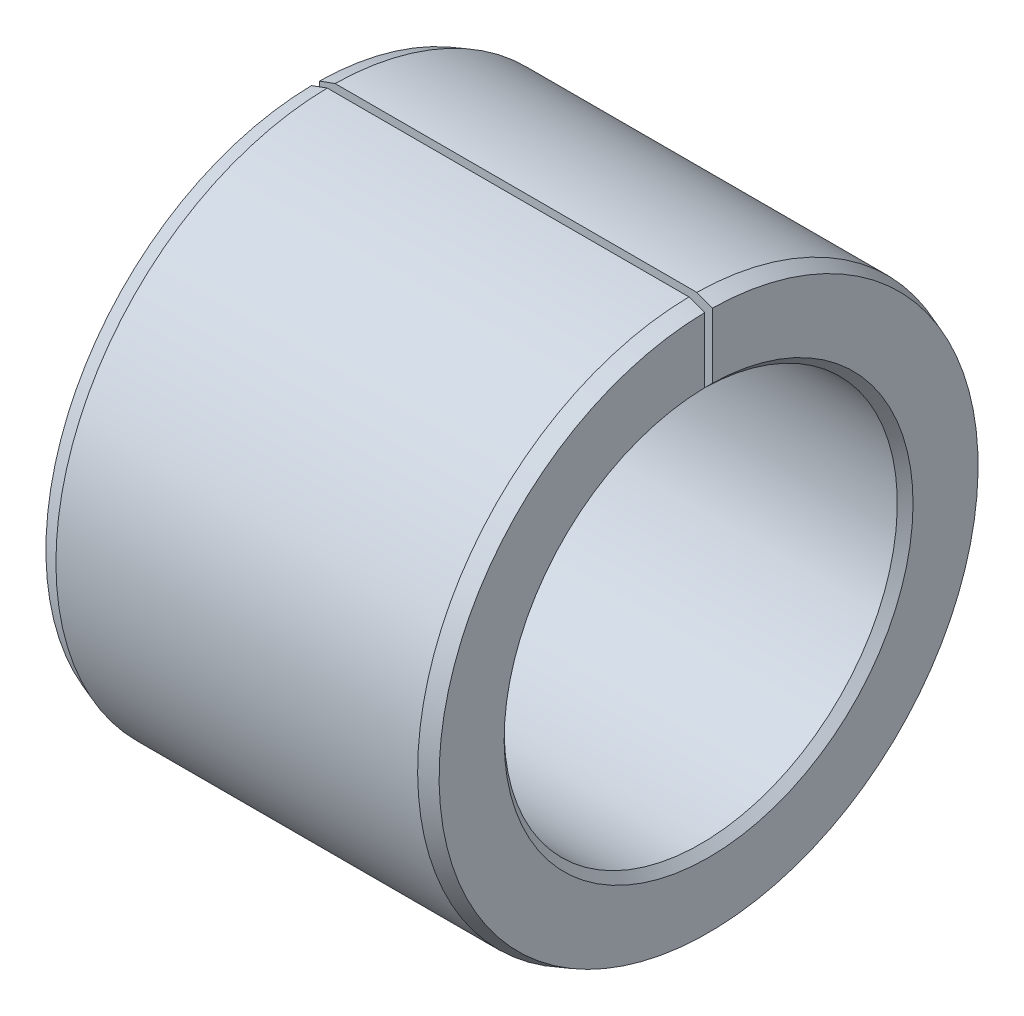
ISO-10303-21;
HEADER;
FILE_DESCRIPTION(('STEP AP214'),'2;1');
FILE_NAME('part.step','',(''),(''),'','','');
FILE_SCHEMA(('AUTOMOTIVE_DESIGN { 1 0 10303 214 1 1 1 1 }'));
ENDSEC;
DATA;
#1=APPLICATION_CONTEXT('core data for automotive mechanical design processes');
#2=APPLICATION_PROTOCOL_DEFINITION('international standard','automotive_design',2000,#1);
#3=PRODUCT_CONTEXT('',#1,'mechanical');
#4=PRODUCT('Part','Part','',(#3));
#5=PRODUCT_RELATED_PRODUCT_CATEGORY('part','',(#4));
#6=PRODUCT_DEFINITION_FORMATION('','',#4);
#7=PRODUCT_DEFINITION_CONTEXT('part definition',#1,'design');
#8=PRODUCT_DEFINITION('design','',#6,#7);
#9=PRODUCT_DEFINITION_SHAPE('','',#8);
#10=(LENGTH_UNIT() NAMED_UNIT(*) SI_UNIT(.MILLI.,.METRE.));
#11=(NAMED_UNIT(*) PLANE_ANGLE_UNIT() SI_UNIT($,.RADIAN.));
#12=(NAMED_UNIT(*) SI_UNIT($,.STERADIAN.) SOLID_ANGLE_UNIT());
#13=UNCERTAINTY_MEASURE_WITH_UNIT(LENGTH_MEASURE(1.E-05),#10,'distance_accuracy_value','');
#14=(GEOMETRIC_REPRESENTATION_CONTEXT(3) GLOBAL_UNCERTAINTY_ASSIGNED_CONTEXT((#13)) GLOBAL_UNIT_ASSIGNED_CONTEXT((#10,
#11,#12)) REPRESENTATION_CONTEXT('',''));
#15=CARTESIAN_POINT('',(0.,0.,0.));
#16=DIRECTION('',(0.,0.,1.));
#17=DIRECTION('',(1.,0.,0.));
#18=AXIS2_PLACEMENT_3D('',#15,#16,#17);
#19=CARTESIAN_POINT('',(5.,0.,0.));
#20=DIRECTION('',(-1.,0.,0.));
#21=DIRECTION('',(0.,0.,1.));
#22=AXIS2_PLACEMENT_3D('',#19,#20,#21);
#23=CONICAL_SURFACE('',#22,3.42720595314676,0.349065850398865);
#24=CARTESIAN_POINT('',(0.244022846625459,5.15799773541858,0.05));
#25=CARTESIAN_POINT('',(1.83894666982947,4.57743598150718,0.05));
#26=CARTESIAN_POINT('',(3.43388498629194,3.99691403257923,0.05));
#27=CARTESIAN_POINT('',(5.8262718141618,3.12607439059351,0.05));
#28=CARTESIAN_POINT('',(6.62373064917274,2.83578505676288,0.05));
#29=CARTESIAN_POINT('',(8.21863437288409,2.25516807840734,0.05));
#30=CARTESIAN_POINT('',(9.0160792615845,1.96484043388241,0.05));
#31=CARTESIAN_POINT('',(9.8135136445679,1.6744839319601,0.05));
#32=B_SPLINE_CURVE_WITH_KNOTS('',3,(#24,#25,#26,#27,#28,#29,#30,#31),.UNSPECIFIED.,.F.,.F.,(4,2,
2,4),(0.,5.09190589439865,7.63785884282154,10.1838117931845),.UNSPECIFIED.);
#33=CARTESIAN_POINT('',(4.8,3.49964283891942,0.05));
#34=VERTEX_POINT('',#33);
#35=CARTESIAN_POINT('',(5.,3.42684120514572,0.05));
#36=VERTEX_POINT('',#35);
#37=EDGE_CURVE('E177',#34,#36,#32,.T.);
#38=ORIENTED_EDGE('',*,*,#37,.F.);
#39=CARTESIAN_POINT('',(4.8,0.,0.));
#40=DIRECTION('',(-1.,0.,0.));
#41=DIRECTION('',(0.,0.,1.));
#42=AXIS2_PLACEMENT_3D('',#39,#40,#41);
#43=CIRCLE('',#42,3.5);
#44=CARTESIAN_POINT('',(4.8,3.49964283891942,-0.05));
#45=VERTEX_POINT('',#44);
#46=EDGE_CURVE('E146',#45,#34,#43,.T.);
#47=ORIENTED_EDGE('',*,*,#46,.F.);
#48=CARTESIAN_POINT('',(9.8135136445679,1.6744839319601,-0.05));
#49=CARTESIAN_POINT('',(9.03154377156572,1.9592097913262,-0.05));
#50=CARTESIAN_POINT('',(8.2495637509779,2.24390777706311,-0.05));
#51=CARTESIAN_POINT('',(6.65466055697699,2.82452621048077,-0.05));
#52=CARTESIAN_POINT('',(5.84173683544576,3.12044515255103,-0.05));
#53=CARTESIAN_POINT('',(3.43388492336243,3.99691385976974,-0.05));
#54=CARTESIAN_POINT('',(1.83894654396745,4.57743563588929,-0.05));
#55=CARTESIAN_POINT('',(0.244022846625459,5.15799773541858,-0.05));
#56=B_SPLINE_CURVE_WITH_KNOTS('',3,(#48,#49,#50,#51,#52,#53,#54,#55),.UNSPECIFIED.,.F.,.F.,(4,2,
2,4),(0.,2.49657991287484,5.09190589880496,10.1838117932036),.UNSPECIFIED.);
#57=CARTESIAN_POINT('',(5.,3.42684120514572,-0.05));
#58=VERTEX_POINT('',#57);
#59=EDGE_CURVE('E48',#58,#45,#56,.T.);
#60=ORIENTED_EDGE('',*,*,#59,.F.);
#61=CARTESIAN_POINT('',(5.,0.,0.));
#62=DIRECTION('',(-1.,0.,0.));
#63=DIRECTION('',(0.,0.,1.));
#64=AXIS2_PLACEMENT_3D('',#61,#62,#63);
#65=CIRCLE('',#64,3.42720595314676);
#66=EDGE_CURVE('E134',#58,#36,#65,.T.);
#67=ORIENTED_EDGE('',*,*,#66,.T.);
#68=EDGE_LOOP('',(#38,#47,#60,#67));
#69=FACE_BOUND('',#68,.T.);
#70=ADVANCED_FACE('F33',(#69),#23,.T.);
#71=CARTESIAN_POINT('',(5.,3.42720595314676,0.));
#72=DIRECTION('',(-1.,0.,0.));
#73=DIRECTION('',(0.,0.,1.));
#74=AXIS2_PLACEMENT_3D('',#71,#72,#73);
#75=PLANE('',#74);
#76=DIRECTION('',(0.,-1.,0.));
#77=VECTOR('',#76,1.);
#78=CARTESIAN_POINT('',(5.,0.,0.05));
#79=LINE('',#78,#77);
#80=CARTESIAN_POINT('',(5.,2.59951918631119,0.05));
#81=VERTEX_POINT('',#80);
#82=EDGE_CURVE('E106',#36,#81,#79,.T.);
#83=ORIENTED_EDGE('',*,*,#82,.F.);
#84=ORIENTED_EDGE('',*,*,#66,.F.);
#85=DIRECTION('',(0.,1.,0.));
#86=VECTOR('',#85,1.);
#87=CARTESIAN_POINT('',(5.,0.,-0.05));
#88=LINE('',#87,#86);
#89=CARTESIAN_POINT('',(5.,2.59951918631119,-0.05));
#90=VERTEX_POINT('',#89);
#91=EDGE_CURVE('E143',#90,#58,#88,.T.);
#92=ORIENTED_EDGE('',*,*,#91,.F.);
#93=CARTESIAN_POINT('',(5.,0.,0.));
#94=DIRECTION('',(-1.,0.,0.));
#95=DIRECTION('',(0.,0.,1.));
#96=AXIS2_PLACEMENT_3D('',#93,#94,#95);
#97=CIRCLE('',#96,2.6);
#98=EDGE_CURVE('E131',#90,#81,#97,.T.);
#99=ORIENTED_EDGE('',*,*,#98,.T.);
#100=EDGE_LOOP('',(#83,#84,#92,#99));
#101=FACE_BOUND('',#100,.T.);
#102=ADVANCED_FACE('F211',(#101),#75,.F.);
#103=CARTESIAN_POINT('',(4.9,0.,0.));
#104=DIRECTION('',(1.,0.,0.));
#105=DIRECTION('',(0.,0.,-1.));
#106=AXIS2_PLACEMENT_3D('',#103,#104,#105);
#107=CONICAL_SURFACE('',#106,2.5,0.785398163397446);
#108=CARTESIAN_POINT('',(6.81140647023019,4.41112310478734,0.05));
#109=CARTESIAN_POINT('',(6.47828942219843,4.07797967910412,0.05));
#110=CARTESIAN_POINT('',(6.14517047463618,3.74483815002296,0.05));
#111=CARTESIAN_POINT('',(5.47894406885656,3.0785436583416,0.05));
#112=CARTESIAN_POINT('',(5.14583661063827,2.74539069574233,0.05));
#113=CARTESIAN_POINT('',(4.64619543655363,2.24564118658937,0.05));
#114=CARTESIAN_POINT('',(4.47965169946284,2.07905465805415,0.05));
#115=CARTESIAN_POINT('',(4.1465779004718,1.74586794919136,0.05));
#116=CARTESIAN_POINT('',(3.98004783857056,1.57926776886479,0.05));
#117=CARTESIAN_POINT('',(3.64702208691153,1.24603298751812,0.05));
#118=CARTESIAN_POINT('',(3.48052639716256,1.07939838648922,0.05));
#119=CARTESIAN_POINT('',(3.23085904163022,0.829370270919732,0.05));
#120=CARTESIAN_POINT('',(3.14764927099729,0.746014848047377,0.05));
#121=CARTESIAN_POINT('',(2.9813335900932,0.579200396773489,0.05));
#122=CARTESIAN_POINT('',(2.89822767987713,0.495741368317047,0.05));
#123=CARTESIAN_POINT('',(2.81521297260192,0.412191475672327,0.05));
#124=B_SPLINE_CURVE_WITH_KNOTS('',3,(#108,#109,#110,#111,#112,#113,#114,#115,#116,#117,#118,
#119,#120,#121,#122,#123),.UNSPECIFIED.,.F.,.F.,(4,2,2,2,2,2,2,4),(0.,1.41335190188535,
2.82670368820202,3.53337970529471,4.24005567078756,4.94673181705697,5.30007002022376,
5.65340841073162),.UNSPECIFIED.);
#125=CARTESIAN_POINT('',(4.9,2.49949994999,0.05));
#126=VERTEX_POINT('',#125);
#127=EDGE_CURVE('E147',#81,#126,#124,.T.);
#128=ORIENTED_EDGE('',*,*,#127,.F.);
#129=ORIENTED_EDGE('',*,*,#98,.F.);
#130=CARTESIAN_POINT('',(2.81521297260192,0.412191475672327,-0.05));
#131=CARTESIAN_POINT('',(2.87234497959749,0.46971697654064,-0.05));
#132=CARTESIAN_POINT('',(2.9295336352839,0.52718608089989,-0.05));
#133=CARTESIAN_POINT('',(3.04397818555412,0.642057261492208,-0.05));
#134=CARTESIAN_POINT('',(3.10123408010453,0.699459337758553,-0.05));
#135=CARTESIAN_POINT('',(3.38756635237691,0.986416409372546,-0.05));
#136=CARTESIAN_POINT('',(3.61680200908241,1.21581235878207,-0.05));
#137=CARTESIAN_POINT('',(4.07530874141732,1.67456903355884,-0.05));
#138=CARTESIAN_POINT('',(4.30457981706423,1.90392975890856,-0.05));
#139=CARTESIAN_POINT('',(4.62682153549985,2.22626168587472,-0.05));
#140=CARTESIAN_POINT('',(4.71978153402603,2.31924352156309,-0.05));
#141=CARTESIAN_POINT('',(5.14583703247529,2.74539010671263,-0.05));
#142=CARTESIAN_POINT('',(5.47894415246897,3.07854323650595,-0.05));
#143=CARTESIAN_POINT('',(6.14517005153926,3.74483823233803,-0.05));
#144=CARTESIAN_POINT('',(6.47828883062266,4.07798009837002,-0.05));
#145=CARTESIAN_POINT('',(6.81140647023019,4.41112310478734,-0.05));
#146=B_SPLINE_CURVE_WITH_KNOTS('',3,(#130,#131,#132,#133,#134,#135,#136,#137,#138,#139,#140,
#141,#142,#143,#144,#145),.UNSPECIFIED.,.F.,.F.,(4,2,2,2,2,2,2,4),(0.,0.243226564415598,
0.486453008028373,1.45935753539831,2.43226254514947,2.82670474230206,4.24005616852189,
5.65340843050408),.UNSPECIFIED.);
#147=CARTESIAN_POINT('',(4.9,2.49949994999,-0.05));
#148=VERTEX_POINT('',#147);
#149=EDGE_CURVE('E199',#148,#90,#146,.T.);
#150=ORIENTED_EDGE('',*,*,#149,.F.);
#151=CARTESIAN_POINT('',(4.9,0.,0.));
#152=DIRECTION('',(-1.,0.,0.));
#153=DIRECTION('',(0.,0.,1.));
#154=AXIS2_PLACEMENT_3D('',#151,#152,#153);
#155=CIRCLE('',#154,2.5);
#156=EDGE_CURVE('E123',#148,#126,#155,.T.);
#157=ORIENTED_EDGE('',*,*,#156,.T.);
#158=EDGE_LOOP('',(#128,#129,#150,#157));
#159=FACE_BOUND('',#158,.T.);
#160=ADVANCED_FACE('F158',(#159),#107,.F.);
#161=CARTESIAN_POINT('',(0.,0.,0.));
#162=DIRECTION('',(-1.,0.,0.));
#163=DIRECTION('',(0.,0.,1.));
#164=AXIS2_PLACEMENT_3D('',#161,#162,#163);
#165=CYLINDRICAL_SURFACE('',#164,2.5);
#166=DIRECTION('',(-1.,0.,0.));
#167=VECTOR('',#166,1.);
#168=CARTESIAN_POINT('',(0.,2.49949994999,0.05));
#169=LINE('',#168,#167);
#170=CARTESIAN_POINT('',(0.0999999999999999,2.49949994999,0.05));
#171=VERTEX_POINT('',#170);
#172=EDGE_CURVE('E156',#126,#171,#169,.T.);
#173=ORIENTED_EDGE('',*,*,#172,.F.);
#174=ORIENTED_EDGE('',*,*,#156,.F.);
#175=DIRECTION('',(-1.,0.,0.));
#176=VECTOR('',#175,1.);
#177=CARTESIAN_POINT('',(0.,2.49949994999,-0.05));
#178=LINE('',#177,#176);
#179=CARTESIAN_POINT('',(0.0999999999999997,2.49949994999,-0.05));
#180=VERTEX_POINT('',#179);
#181=EDGE_CURVE('E117',#180,#148,#178,.F.);
#182=ORIENTED_EDGE('',*,*,#181,.F.);
#183=CARTESIAN_POINT('',(0.0999999999999997,0.,0.));
#184=DIRECTION('',(-1.,0.,0.));
#185=DIRECTION('',(0.,0.,1.));
#186=AXIS2_PLACEMENT_3D('',#183,#184,#185);
#187=CIRCLE('',#186,2.5);
#188=EDGE_CURVE('E116',#180,#171,#187,.T.);
#189=ORIENTED_EDGE('',*,*,#188,.T.);
#190=EDGE_LOOP('',(#173,#174,#182,#189));
#191=FACE_BOUND('',#190,.T.);
#192=ADVANCED_FACE('F189',(#191),#165,.F.);
#193=CARTESIAN_POINT('',(0.,0.,0.));
#194=DIRECTION('',(-1.,0.,0.));
#195=DIRECTION('',(0.,0.,1.));
#196=AXIS2_PLACEMENT_3D('',#193,#194,#195);
#197=CONICAL_SURFACE('',#196,2.6,0.785398163397449);
#198=CARTESIAN_POINT('',(2.18478702739807,0.412191475672324,0.05));
#199=CARTESIAN_POINT('',(2.1276550204025,0.469716976540637,0.05));
#200=CARTESIAN_POINT('',(2.07046636471609,0.527186080899886,0.05));
#201=CARTESIAN_POINT('',(1.95602181444587,0.642057261492203,0.05));
#202=CARTESIAN_POINT('',(1.89876591989547,0.699459337758547,0.05));
#203=CARTESIAN_POINT('',(1.61243364762309,0.986416409372539,0.05));
#204=CARTESIAN_POINT('',(1.38319799091759,1.21581235878206,0.05));
#205=CARTESIAN_POINT('',(0.924691258582691,1.67456903355882,0.05));
#206=CARTESIAN_POINT('',(0.695420182935782,1.90392975890855,0.05));
#207=CARTESIAN_POINT('',(0.373178464500153,2.22626168587471,0.05));
#208=CARTESIAN_POINT('',(0.280218465973971,2.31924352156308,0.05));
#209=CARTESIAN_POINT('',(-0.145837032475286,2.74539010671263,0.05));
#210=CARTESIAN_POINT('',(-0.478944152468961,3.07854323650594,0.05));
#211=CARTESIAN_POINT('',(-1.14517005153926,3.74483823233803,0.05));
#212=CARTESIAN_POINT('',(-1.47828883062265,4.07798009837002,0.05));
#213=CARTESIAN_POINT('',(-1.81140647023018,4.41112310478735,0.05));
#214=B_SPLINE_CURVE_WITH_KNOTS('',3,(#198,#199,#200,#201,#202,#203,#204,#205,#206,#207,#208,
#209,#210,#211,#212,#213),.UNSPECIFIED.,.F.,.F.,(4,2,2,2,2,2,2,4),(0.,0.243226564415595,
0.486453008028369,1.4593575353983,2.43226254514945,2.82670474230206,4.24005616852188,
5.65340843050407),.UNSPECIFIED.);
#215=CARTESIAN_POINT('',(0.,2.59951918631119,0.05));
#216=VERTEX_POINT('',#215);
#217=EDGE_CURVE('E181',#171,#216,#214,.T.);
#218=ORIENTED_EDGE('',*,*,#217,.F.);
#219=ORIENTED_EDGE('',*,*,#188,.F.);
#220=CARTESIAN_POINT('',(-1.81140647023018,4.41112310478735,-0.05));
#221=CARTESIAN_POINT('',(-1.47828942219842,4.07797967910412,-0.05));
#222=CARTESIAN_POINT('',(-1.14517047463617,3.74483815002296,-0.05));
#223=CARTESIAN_POINT('',(-0.478944068856563,3.0785436583416,-0.05));
#224=CARTESIAN_POINT('',(-0.145836610638268,2.74539069574233,-0.05));
#225=CARTESIAN_POINT('',(0.353804563446363,2.24564118658937,-0.05));
#226=CARTESIAN_POINT('',(0.520348300537155,2.07905465805415,-0.05));
#227=CARTESIAN_POINT('',(0.853422099528192,1.74586794919136,-0.05));
#228=CARTESIAN_POINT('',(1.01995216142944,1.57926776886479,-0.05));
#229=CARTESIAN_POINT('',(1.35297791308846,1.24603298751812,-0.05));
#230=CARTESIAN_POINT('',(1.51947360283744,1.07939838648922,-0.05));
#231=CARTESIAN_POINT('',(1.76914095836977,0.82937027091973,-0.05));
#232=CARTESIAN_POINT('',(1.8523507290027,0.746014848047374,-0.05));
#233=CARTESIAN_POINT('',(2.0186664099068,0.579200396773486,-0.05));
#234=CARTESIAN_POINT('',(2.10177232012286,0.495741368317044,-0.05));
#235=CARTESIAN_POINT('',(2.18478702739807,0.412191475672324,-0.05));
#236=B_SPLINE_CURVE_WITH_KNOTS('',3,(#220,#221,#222,#223,#224,#225,#226,#227,#228,#229,#230,
#231,#232,#233,#234,#235),.UNSPECIFIED.,.F.,.F.,(4,2,2,2,2,2,2,4),(0.,1.41335190188535,
2.82670368820201,3.53337970529471,4.24005567078756,4.94673181705696,5.30007002022376,
5.65340841073161),.UNSPECIFIED.);
#237=CARTESIAN_POINT('',(0.,2.59951918631119,-0.05));
#238=VERTEX_POINT('',#237);
#239=EDGE_CURVE('E98',#238,#180,#236,.T.);
#240=ORIENTED_EDGE('',*,*,#239,.F.);
#241=CARTESIAN_POINT('',(0.,0.,0.));
#242=DIRECTION('',(-1.,0.,0.));
#243=DIRECTION('',(0.,0.,1.));
#244=AXIS2_PLACEMENT_3D('',#241,#242,#243);
#245=CIRCLE('',#244,2.6);
#246=EDGE_CURVE('E114',#238,#216,#245,.T.);
#247=ORIENTED_EDGE('',*,*,#246,.T.);
#248=EDGE_LOOP('',(#218,#219,#240,#247));
#249=FACE_BOUND('',#248,.T.);
#250=ADVANCED_FACE('F113',(#249),#197,.F.);
#251=CARTESIAN_POINT('',(0.,2.6,0.));
#252=DIRECTION('',(1.,0.,0.));
#253=DIRECTION('',(0.,0.,-1.));
#254=AXIS2_PLACEMENT_3D('',#251,#252,#253);
#255=PLANE('',#254);
#256=DIRECTION('',(0.,-1.,0.));
#257=VECTOR('',#256,1.);
#258=CARTESIAN_POINT('',(0.,0.,0.05));
#259=LINE('',#258,#257);
#260=CARTESIAN_POINT('',(0.,3.42684120514572,0.05));
#261=VERTEX_POINT('',#260);
#262=EDGE_CURVE('E107',#261,#216,#259,.T.);
#263=ORIENTED_EDGE('',*,*,#262,.T.);
#264=ORIENTED_EDGE('',*,*,#246,.F.);
#265=DIRECTION('',(0.,1.,0.));
#266=VECTOR('',#265,1.);
#267=CARTESIAN_POINT('',(0.,0.,-0.05));
#268=LINE('',#267,#266);
#269=CARTESIAN_POINT('',(0.,3.42684120514572,-0.05));
#270=VERTEX_POINT('',#269);
#271=EDGE_CURVE('E95',#238,#270,#268,.T.);
#272=ORIENTED_EDGE('',*,*,#271,.T.);
#273=CARTESIAN_POINT('',(0.,0.,0.));
#274=DIRECTION('',(-1.,0.,0.));
#275=DIRECTION('',(0.,0.,1.));
#276=AXIS2_PLACEMENT_3D('',#273,#274,#275);
#277=CIRCLE('',#276,3.42720595314676);
#278=EDGE_CURVE('E121',#270,#261,#277,.T.);
#279=ORIENTED_EDGE('',*,*,#278,.T.);
#280=EDGE_LOOP('',(#263,#264,#272,#279));
#281=FACE_BOUND('',#280,.T.);
#282=ADVANCED_FACE('F120',(#281),#255,.F.);
#283=CARTESIAN_POINT('',(0.2,0.,0.));
#284=DIRECTION('',(1.,0.,0.));
#285=DIRECTION('',(0.,0.,-1.));
#286=AXIS2_PLACEMENT_3D('',#283,#284,#285);
#287=CONICAL_SURFACE('',#286,3.5,0.349065850398867);
#288=CARTESIAN_POINT('',(-4.81351364456789,1.67448393196009,0.05));
#289=CARTESIAN_POINT('',(-4.03154377156572,1.95920979132619,0.05));
#290=CARTESIAN_POINT('',(-3.24956375097791,2.2439077770631,0.05));
#291=CARTESIAN_POINT('',(-1.65466055697699,2.82452621048077,0.05));
#292=CARTESIAN_POINT('',(-0.841736835445765,3.12044515255103,0.05));
#293=CARTESIAN_POINT('',(1.56611507663756,3.99691385976974,0.05));
#294=CARTESIAN_POINT('',(3.16105345603254,4.57743563588929,0.05));
#295=CARTESIAN_POINT('',(4.75597715337453,5.15799773541858,0.05));
#296=B_SPLINE_CURVE_WITH_KNOTS('',3,(#288,#289,#290,#291,#292,#293,#294,#295),.UNSPECIFIED.,.F.,
.F.,(4,2,2,4),(0.,2.49657991287483,5.09190589880496,10.1838117932036),.UNSPECIFIED.);
#297=CARTESIAN_POINT('',(0.2,3.49964283891942,0.05));
#298=VERTEX_POINT('',#297);
#299=EDGE_CURVE('E55',#261,#298,#296,.T.);
#300=ORIENTED_EDGE('',*,*,#299,.F.);
#301=ORIENTED_EDGE('',*,*,#278,.F.);
#302=CARTESIAN_POINT('',(4.75597715337453,5.15799773541858,-0.05));
#303=CARTESIAN_POINT('',(3.16105333017051,4.57743598150718,-0.05));
#304=CARTESIAN_POINT('',(1.56611501370805,3.99691403257923,-0.05));
#305=CARTESIAN_POINT('',(-0.826271814161801,3.12607439059351,-0.05));
#306=CARTESIAN_POINT('',(-1.62373064917273,2.83578505676288,-0.05));
#307=CARTESIAN_POINT('',(-3.21863437288409,2.25516807840734,-0.05));
#308=CARTESIAN_POINT('',(-4.0160792615845,1.9648404338824,-0.05));
#309=CARTESIAN_POINT('',(-4.81351364456789,1.67448393196009,-0.05));
#310=B_SPLINE_CURVE_WITH_KNOTS('',3,(#302,#303,#304,#305,#306,#307,#308,#309),.UNSPECIFIED.,.F.,
.F.,(4,2,2,4),(0.,5.09190589439864,7.63785884282153,10.1838117931845),.UNSPECIFIED.);
#311=CARTESIAN_POINT('',(0.2,3.49964283891942,-0.05));
#312=VERTEX_POINT('',#311);
#313=EDGE_CURVE('E101',#312,#270,#310,.T.);
#314=ORIENTED_EDGE('',*,*,#313,.F.);
#315=CARTESIAN_POINT('',(0.2,0.,0.));
#316=DIRECTION('',(-1.,0.,0.));
#317=DIRECTION('',(0.,0.,1.));
#318=AXIS2_PLACEMENT_3D('',#315,#316,#317);
#319=CIRCLE('',#318,3.5);
#320=EDGE_CURVE('E125',#312,#298,#319,.T.);
#321=ORIENTED_EDGE('',*,*,#320,.T.);
#322=EDGE_LOOP('',(#300,#301,#314,#321));
#323=FACE_BOUND('',#322,.T.);
#324=ADVANCED_FACE('F142',(#323),#287,.T.);
#325=CARTESIAN_POINT('',(0.,0.,0.));
#326=DIRECTION('',(-1.,0.,0.));
#327=DIRECTION('',(0.,0.,1.));
#328=AXIS2_PLACEMENT_3D('',#325,#326,#327);
#329=CYLINDRICAL_SURFACE('',#328,3.5);
#330=DIRECTION('',(-1.,0.,0.));
#331=VECTOR('',#330,1.);
#332=CARTESIAN_POINT('',(0.,3.49964283891942,0.05));
#333=LINE('',#332,#331);
#334=EDGE_CURVE('E11',#298,#34,#333,.F.);
#335=ORIENTED_EDGE('',*,*,#334,.F.);
#336=ORIENTED_EDGE('',*,*,#320,.F.);
#337=DIRECTION('',(-1.,0.,0.));
#338=VECTOR('',#337,1.);
#339=CARTESIAN_POINT('',(0.,3.49964283891942,-0.05));
#340=LINE('',#339,#338);
#341=EDGE_CURVE('E41',#45,#312,#340,.T.);
#342=ORIENTED_EDGE('',*,*,#341,.F.);
#343=ORIENTED_EDGE('',*,*,#46,.T.);
#344=EDGE_LOOP('',(#335,#336,#342,#343));
#345=FACE_BOUND('',#344,.T.);
#346=ADVANCED_FACE('F145',(#345),#329,.T.);
#347=CARTESIAN_POINT('',(5.,0.,-0.05));
#348=DIRECTION('',(0.,0.,1.));
#349=DIRECTION('',(1.,0.,0.));
#350=AXIS2_PLACEMENT_3D('',#347,#348,#349);
#351=PLANE('',#350);
#352=ORIENTED_EDGE('',*,*,#149,.T.);
#353=ORIENTED_EDGE('',*,*,#91,.T.);
#354=ORIENTED_EDGE('',*,*,#59,.T.);
#355=ORIENTED_EDGE('',*,*,#341,.T.);
#356=ORIENTED_EDGE('',*,*,#313,.T.);
#357=ORIENTED_EDGE('',*,*,#271,.F.);
#358=ORIENTED_EDGE('',*,*,#239,.T.);
#359=ORIENTED_EDGE('',*,*,#181,.T.);
#360=EDGE_LOOP('',(#352,#353,#354,#355,#356,#357,#358,#359));
#361=FACE_BOUND('',#360,.T.);
#362=ADVANCED_FACE('F97',(#361),#351,.T.);
#363=CARTESIAN_POINT('',(5.,0.,0.05));
#364=DIRECTION('',(0.,0.,-1.));
#365=DIRECTION('',(-1.,0.,0.));
#366=AXIS2_PLACEMENT_3D('',#363,#364,#365);
#367=PLANE('',#366);
#368=ORIENTED_EDGE('',*,*,#127,.T.);
#369=ORIENTED_EDGE('',*,*,#172,.T.);
#370=ORIENTED_EDGE('',*,*,#217,.T.);
#371=ORIENTED_EDGE('',*,*,#262,.F.);
#372=ORIENTED_EDGE('',*,*,#299,.T.);
#373=ORIENTED_EDGE('',*,*,#334,.T.);
#374=ORIENTED_EDGE('',*,*,#37,.T.);
#375=ORIENTED_EDGE('',*,*,#82,.T.);
#376=EDGE_LOOP('',(#368,#369,#370,#371,#372,#373,#374,#375));
#377=FACE_BOUND('',#376,.T.);
#378=ADVANCED_FACE('F161',(#377),#367,.T.);
#379=CLOSED_SHELL('',(#70,#102,#160,#192,#250,#282,#324,#346,#362,#378));
#380=MANIFOLD_SOLID_BREP('B2',#379);
#381=ADVANCED_BREP_SHAPE_REPRESENTATION('',(#18,#380),#14);
#382=SHAPE_DEFINITION_REPRESENTATION(#9,#381);
ENDSEC;
END-ISO-10303-21;
